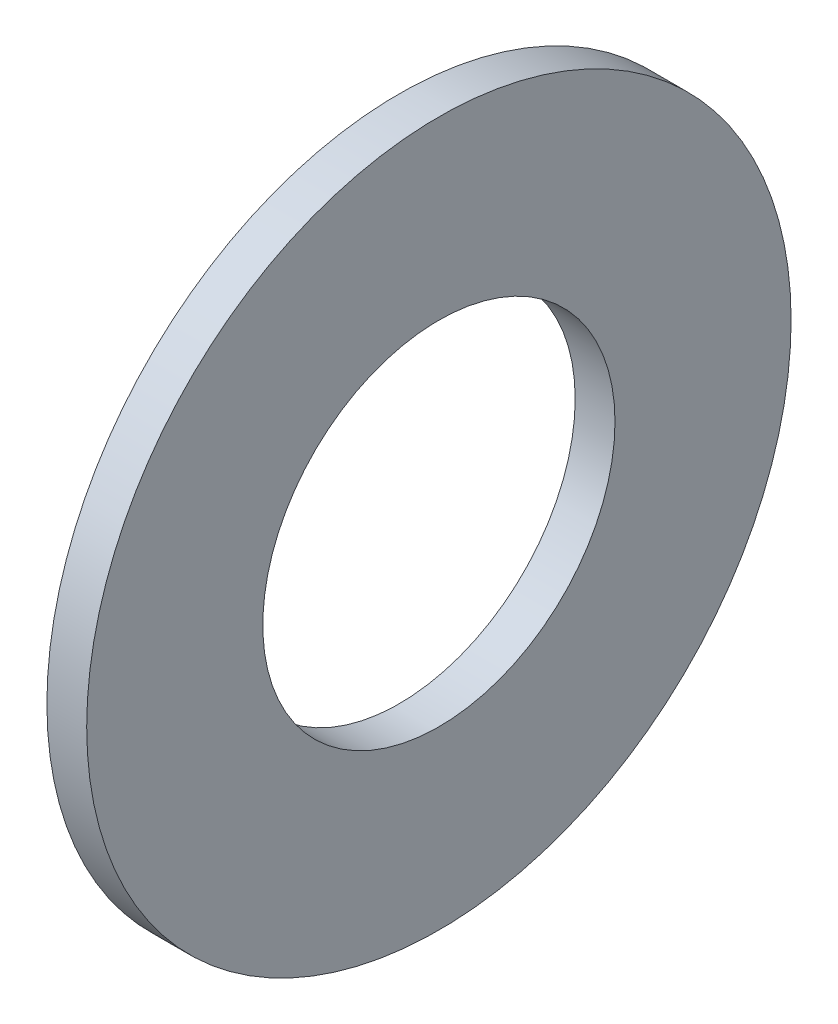
ISO-10303-21;
HEADER;
FILE_DESCRIPTION(('STEP AP214'),'2;1');
FILE_NAME('part.step','',(''),(''),'','','');
FILE_SCHEMA(('AUTOMOTIVE_DESIGN { 1 0 10303 214 1 1 1 1 }'));
ENDSEC;
DATA;
#1=APPLICATION_CONTEXT('core data for automotive mechanical design processes');
#2=APPLICATION_PROTOCOL_DEFINITION('international standard','automotive_design',2000,#1);
#3=PRODUCT_CONTEXT('',#1,'mechanical');
#4=PRODUCT('Part','Part','',(#3));
#5=PRODUCT_RELATED_PRODUCT_CATEGORY('part','',(#4));
#6=PRODUCT_DEFINITION_FORMATION('','',#4);
#7=PRODUCT_DEFINITION_CONTEXT('part definition',#1,'design');
#8=PRODUCT_DEFINITION('design','',#6,#7);
#9=PRODUCT_DEFINITION_SHAPE('','',#8);
#10=(LENGTH_UNIT() NAMED_UNIT(*) SI_UNIT(.MILLI.,.METRE.));
#11=(NAMED_UNIT(*) PLANE_ANGLE_UNIT() SI_UNIT($,.RADIAN.));
#12=(NAMED_UNIT(*) SI_UNIT($,.STERADIAN.) SOLID_ANGLE_UNIT());
#13=UNCERTAINTY_MEASURE_WITH_UNIT(LENGTH_MEASURE(1.E-05),#10,'distance_accuracy_value','');
#14=(GEOMETRIC_REPRESENTATION_CONTEXT(3) GLOBAL_UNCERTAINTY_ASSIGNED_CONTEXT((#13)) GLOBAL_UNIT_ASSIGNED_CONTEXT((#10,
#11,#12)) REPRESENTATION_CONTEXT('',''));
#15=CARTESIAN_POINT('',(0.,0.,0.));
#16=DIRECTION('',(0.,0.,1.));
#17=DIRECTION('',(1.,0.,0.));
#18=AXIS2_PLACEMENT_3D('',#15,#16,#17);
#19=CARTESIAN_POINT('',(1.524,0.,0.));
#20=DIRECTION('',(1.,0.,0.));
#21=DIRECTION('',(0.,0.,-1.));
#22=AXIS2_PLACEMENT_3D('',#19,#20,#21);
#23=PLANE('',#22);
#24=CARTESIAN_POINT('',(1.524,0.,0.));
#25=DIRECTION('',(1.,0.,0.));
#26=DIRECTION('',(0.,0.,-1.));
#27=AXIS2_PLACEMENT_3D('',#24,#25,#26);
#28=CIRCLE('',#27,13.4874);
#29=CARTESIAN_POINT('',(1.524,0.,-13.4874));
#30=VERTEX_POINT('',#29);
#31=EDGE_CURVE('E10',#30,#30,#28,.T.);
#32=ORIENTED_EDGE('',*,*,#31,.T.);
#33=EDGE_LOOP('',(#32));
#34=FACE_BOUND('',#33,.T.);
#35=CARTESIAN_POINT('',(1.524,0.,0.));
#36=DIRECTION('',(1.,0.,0.));
#37=DIRECTION('',(0.,0.,-1.));
#38=AXIS2_PLACEMENT_3D('',#35,#36,#37);
#39=CIRCLE('',#38,6.7437);
#40=CARTESIAN_POINT('',(1.524,0.,-6.7437));
#41=VERTEX_POINT('',#40);
#42=EDGE_CURVE('E42',#41,#41,#39,.T.);
#43=ORIENTED_EDGE('',*,*,#42,.F.);
#44=EDGE_LOOP('',(#43));
#45=FACE_BOUND('',#44,.T.);
#46=ADVANCED_FACE('F31',(#34,#45),#23,.T.);
#47=CARTESIAN_POINT('',(0.,0.,0.));
#48=DIRECTION('',(1.,0.,0.));
#49=DIRECTION('',(0.,0.,-1.));
#50=AXIS2_PLACEMENT_3D('',#47,#48,#49);
#51=PLANE('',#50);
#52=CARTESIAN_POINT('',(0.,0.,0.));
#53=DIRECTION('',(1.,0.,0.));
#54=DIRECTION('',(0.,0.,-1.));
#55=AXIS2_PLACEMENT_3D('',#52,#53,#54);
#56=CIRCLE('',#55,13.4874);
#57=CARTESIAN_POINT('',(0.,0.,-13.4874));
#58=VERTEX_POINT('',#57);
#59=EDGE_CURVE('E35',#58,#58,#56,.T.);
#60=ORIENTED_EDGE('',*,*,#59,.F.);
#61=EDGE_LOOP('',(#60));
#62=FACE_BOUND('',#61,.T.);
#63=CARTESIAN_POINT('',(0.,0.,0.));
#64=DIRECTION('',(1.,0.,0.));
#65=DIRECTION('',(0.,0.,-1.));
#66=AXIS2_PLACEMENT_3D('',#63,#64,#65);
#67=CIRCLE('',#66,6.7437);
#68=CARTESIAN_POINT('',(0.,0.,-6.7437));
#69=VERTEX_POINT('',#68);
#70=EDGE_CURVE('E44',#69,#69,#67,.T.);
#71=ORIENTED_EDGE('',*,*,#70,.T.);
#72=EDGE_LOOP('',(#71));
#73=FACE_BOUND('',#72,.T.);
#74=ADVANCED_FACE('F54',(#62,#73),#51,.F.);
#75=CARTESIAN_POINT('',(1.524,0.,0.));
#76=DIRECTION('',(-1.,0.,0.));
#77=DIRECTION('',(0.,0.,1.));
#78=AXIS2_PLACEMENT_3D('',#75,#76,#77);
#79=CYLINDRICAL_SURFACE('',#78,13.4874);
#80=ORIENTED_EDGE('',*,*,#31,.F.);
#81=EDGE_LOOP('',(#80));
#82=FACE_BOUND('',#81,.T.);
#83=ORIENTED_EDGE('',*,*,#59,.T.);
#84=EDGE_LOOP('',(#83));
#85=FACE_BOUND('',#84,.T.);
#86=ADVANCED_FACE('F33',(#82,#85),#79,.T.);
#87=CARTESIAN_POINT('',(1.524,0.,0.));
#88=DIRECTION('',(-1.,0.,0.));
#89=DIRECTION('',(0.,0.,1.));
#90=AXIS2_PLACEMENT_3D('',#87,#88,#89);
#91=CYLINDRICAL_SURFACE('',#90,6.7437);
#92=ORIENTED_EDGE('',*,*,#42,.T.);
#93=EDGE_LOOP('',(#92));
#94=FACE_BOUND('',#93,.T.);
#95=ORIENTED_EDGE('',*,*,#70,.F.);
#96=EDGE_LOOP('',(#95));
#97=FACE_BOUND('',#96,.T.);
#98=ADVANCED_FACE('F50',(#94,#97),#91,.F.);
#99=CLOSED_SHELL('',(#46,#74,#86,#98));
#100=MANIFOLD_SOLID_BREP('B2',#99);
#101=ADVANCED_BREP_SHAPE_REPRESENTATION('',(#18,#100),#14);
#102=SHAPE_DEFINITION_REPRESENTATION(#9,#101);
ENDSEC;
END-ISO-10303-21;
